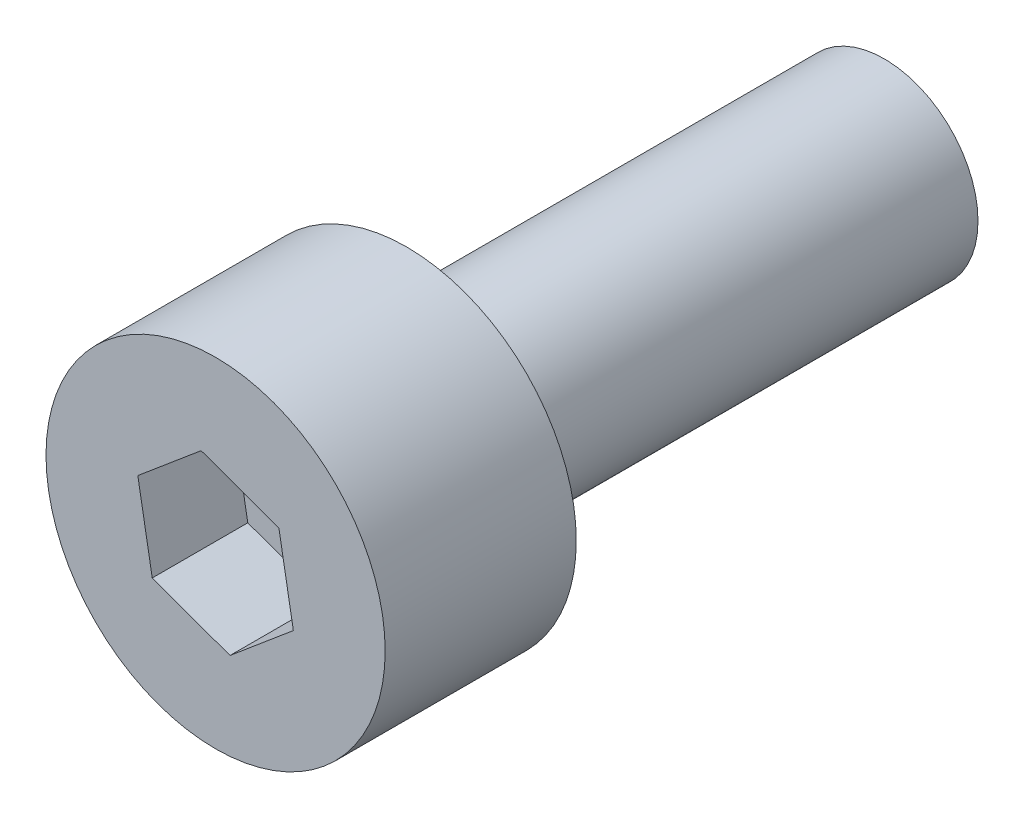
ISO-10303-21;
HEADER;
FILE_DESCRIPTION(('STEP AP214'),'2;1');
FILE_NAME('part.step','',(''),(''),'','','');
FILE_SCHEMA(('AUTOMOTIVE_DESIGN { 1 0 10303 214 1 1 1 1 }'));
ENDSEC;
DATA;
#1=APPLICATION_CONTEXT('core data for automotive mechanical design processes');
#2=APPLICATION_PROTOCOL_DEFINITION('international standard','automotive_design',2000,#1);
#3=PRODUCT_CONTEXT('',#1,'mechanical');
#4=PRODUCT('Part','Part','',(#3));
#5=PRODUCT_RELATED_PRODUCT_CATEGORY('part','',(#4));
#6=PRODUCT_DEFINITION_FORMATION('','',#4);
#7=PRODUCT_DEFINITION_CONTEXT('part definition',#1,'design');
#8=PRODUCT_DEFINITION('design','',#6,#7);
#9=PRODUCT_DEFINITION_SHAPE('','',#8);
#10=(LENGTH_UNIT() NAMED_UNIT(*) SI_UNIT(.MILLI.,.METRE.));
#11=(NAMED_UNIT(*) PLANE_ANGLE_UNIT() SI_UNIT($,.RADIAN.));
#12=(NAMED_UNIT(*) SI_UNIT($,.STERADIAN.) SOLID_ANGLE_UNIT());
#13=UNCERTAINTY_MEASURE_WITH_UNIT(LENGTH_MEASURE(1.E-05),#10,'distance_accuracy_value','');
#14=(GEOMETRIC_REPRESENTATION_CONTEXT(3) GLOBAL_UNCERTAINTY_ASSIGNED_CONTEXT((#13)) GLOBAL_UNIT_ASSIGNED_CONTEXT((#10,
#11,#12)) REPRESENTATION_CONTEXT('',''));
#15=CARTESIAN_POINT('',(0.,0.,0.));
#16=DIRECTION('',(0.,0.,1.));
#17=DIRECTION('',(1.,0.,0.));
#18=AXIS2_PLACEMENT_3D('',#15,#16,#17);
#19=CARTESIAN_POINT('',(0.,0.,10.));
#20=DIRECTION('',(0.,0.,-1.));
#21=DIRECTION('',(-1.,0.,0.));
#22=AXIS2_PLACEMENT_3D('',#19,#20,#21);
#23=CYLINDRICAL_SURFACE('',#22,1.96);
#24=CARTESIAN_POINT('',(0.,0.,10.));
#25=DIRECTION('',(0.,0.,1.));
#26=DIRECTION('',(1.,0.,0.));
#27=AXIS2_PLACEMENT_3D('',#24,#25,#26);
#28=CIRCLE('',#27,1.96);
#29=CARTESIAN_POINT('',(1.96,0.,10.));
#30=VERTEX_POINT('',#29);
#31=EDGE_CURVE('E11',#30,#30,#28,.T.);
#32=ORIENTED_EDGE('',*,*,#31,.F.);
#33=EDGE_LOOP('',(#32));
#34=FACE_BOUND('',#33,.T.);
#35=CARTESIAN_POINT('',(0.,0.,0.));
#36=DIRECTION('',(0.,0.,1.));
#37=DIRECTION('',(1.,0.,0.));
#38=AXIS2_PLACEMENT_3D('',#35,#36,#37);
#39=CIRCLE('',#38,1.96);
#40=CARTESIAN_POINT('',(1.96,0.,0.));
#41=VERTEX_POINT('',#40);
#42=EDGE_CURVE('E35',#41,#41,#39,.T.);
#43=ORIENTED_EDGE('',*,*,#42,.T.);
#44=EDGE_LOOP('',(#43));
#45=FACE_BOUND('',#44,.T.);
#46=ADVANCED_FACE('F32',(#34,#45),#23,.T.);
#47=CARTESIAN_POINT('',(0.,0.,0.));
#48=DIRECTION('',(0.,0.,1.));
#49=DIRECTION('',(1.,0.,0.));
#50=AXIS2_PLACEMENT_3D('',#47,#48,#49);
#51=PLANE('',#50);
#52=ORIENTED_EDGE('',*,*,#42,.F.);
#53=EDGE_LOOP('',(#52));
#54=FACE_BOUND('',#53,.T.);
#55=ADVANCED_FACE('F150',(#54),#51,.F.);
#56=CARTESIAN_POINT('',(0.,0.,10.));
#57=DIRECTION('',(0.,0.,1.));
#58=DIRECTION('',(1.,0.,0.));
#59=AXIS2_PLACEMENT_3D('',#56,#57,#58);
#60=PLANE('',#59);
#61=CARTESIAN_POINT('',(0.,0.,10.));
#62=DIRECTION('',(0.,0.,1.));
#63=DIRECTION('',(1.,0.,0.));
#64=AXIS2_PLACEMENT_3D('',#61,#62,#63);
#65=CIRCLE('',#64,3.55);
#66=CARTESIAN_POINT('',(3.55,0.,10.));
#67=VERTEX_POINT('',#66);
#68=EDGE_CURVE('E133',#67,#67,#65,.T.);
#69=ORIENTED_EDGE('',*,*,#68,.F.);
#70=EDGE_LOOP('',(#69));
#71=FACE_BOUND('',#70,.T.);
#72=ORIENTED_EDGE('',*,*,#31,.T.);
#73=EDGE_LOOP('',(#72));
#74=FACE_BOUND('',#73,.T.);
#75=ADVANCED_FACE('F147',(#71,#74),#60,.F.);
#76=CARTESIAN_POINT('',(0.,0.,14.));
#77=DIRECTION('',(0.,0.,-1.));
#78=DIRECTION('',(-1.,0.,0.));
#79=AXIS2_PLACEMENT_3D('',#76,#77,#78);
#80=CYLINDRICAL_SURFACE('',#79,3.55);
#81=CARTESIAN_POINT('',(0.,0.,14.));
#82=DIRECTION('',(0.,0.,1.));
#83=DIRECTION('',(1.,0.,0.));
#84=AXIS2_PLACEMENT_3D('',#81,#82,#83);
#85=CIRCLE('',#84,3.55);
#86=CARTESIAN_POINT('',(3.55,0.,14.));
#87=VERTEX_POINT('',#86);
#88=EDGE_CURVE('E139',#87,#87,#85,.T.);
#89=ORIENTED_EDGE('',*,*,#88,.F.);
#90=EDGE_LOOP('',(#89));
#91=FACE_BOUND('',#90,.T.);
#92=ORIENTED_EDGE('',*,*,#68,.T.);
#93=EDGE_LOOP('',(#92));
#94=FACE_BOUND('',#93,.T.);
#95=ADVANCED_FACE('F145',(#91,#94),#80,.T.);
#96=CARTESIAN_POINT('',(0.,0.,14.));
#97=DIRECTION('',(0.,0.,1.));
#98=DIRECTION('',(1.,0.,0.));
#99=AXIS2_PLACEMENT_3D('',#96,#97,#98);
#100=PLANE('',#99);
#101=DIRECTION('',(-0.174536153569573,0.984650766057254,0.));
#102=VECTOR('',#101,1.);
#103=CARTESIAN_POINT('',(1.62812889195595,-0.590928346907031,14.));
#104=LINE('',#103,#102);
#105=CARTESIAN_POINT('',(1.62812889195595,-0.590928346907031,14.));
#106=VERTEX_POINT('',#105);
#107=CARTESIAN_POINT('',(1.32582340621581,1.11453680761575,14.));
#108=VERTEX_POINT('',#107);
#109=EDGE_CURVE('E46',#106,#108,#104,.T.);
#110=ORIENTED_EDGE('',*,*,#109,.F.);
#111=DIRECTION('',(0.765464500476604,0.6434781258987,0.));
#112=VECTOR('',#111,1.);
#113=CARTESIAN_POINT('',(0.302305485740145,-1.70546515452278,14.));
#114=LINE('',#113,#112);
#115=CARTESIAN_POINT('',(0.302305485740145,-1.70546515452278,14.));
#116=VERTEX_POINT('',#115);
#117=EDGE_CURVE('E129',#116,#106,#114,.T.);
#118=ORIENTED_EDGE('',*,*,#117,.F.);
#119=DIRECTION('',(0.940000654046177,-0.341172640158555,0.));
#120=VECTOR('',#119,1.);
#121=CARTESIAN_POINT('',(-1.32582340621581,-1.11453680761575,14.));
#122=LINE('',#121,#120);
#123=CARTESIAN_POINT('',(-1.32582340621581,-1.11453680761575,14.));
#124=VERTEX_POINT('',#123);
#125=EDGE_CURVE('E127',#124,#116,#122,.T.);
#126=ORIENTED_EDGE('',*,*,#125,.F.);
#127=DIRECTION('',(0.174536153569573,-0.984650766057255,0.));
#128=VECTOR('',#127,1.);
#129=CARTESIAN_POINT('',(-1.62812889195595,0.59092834690703,14.));
#130=LINE('',#129,#128);
#131=CARTESIAN_POINT('',(-1.62812889195595,0.59092834690703,14.));
#132=VERTEX_POINT('',#131);
#133=EDGE_CURVE('E94',#132,#124,#130,.T.);
#134=ORIENTED_EDGE('',*,*,#133,.F.);
#135=DIRECTION('',(-0.765464500476604,-0.6434781258987,0.));
#136=VECTOR('',#135,1.);
#137=CARTESIAN_POINT('',(-0.302305485740145,1.70546515452278,14.));
#138=LINE('',#137,#136);
#139=CARTESIAN_POINT('',(-0.302305485740145,1.70546515452278,14.));
#140=VERTEX_POINT('',#139);
#141=EDGE_CURVE('E123',#140,#132,#138,.T.);
#142=ORIENTED_EDGE('',*,*,#141,.F.);
#143=DIRECTION('',(-0.940000654046177,0.341172640158555,0.));
#144=VECTOR('',#143,1.);
#145=CARTESIAN_POINT('',(1.32582340621581,1.11453680761575,14.));
#146=LINE('',#145,#144);
#147=EDGE_CURVE('E120',#108,#140,#146,.T.);
#148=ORIENTED_EDGE('',*,*,#147,.F.);
#149=EDGE_LOOP('',(#110,#118,#126,#134,#142,#148));
#150=FACE_BOUND('',#149,.T.);
#151=ORIENTED_EDGE('',*,*,#88,.T.);
#152=EDGE_LOOP('',(#151));
#153=FACE_BOUND('',#152,.T.);
#154=ADVANCED_FACE('F164',(#150,#153),#100,.T.);
#155=CARTESIAN_POINT('',(1.62812889195595,-0.590928346907031,12.));
#156=DIRECTION('',(0.984650766057255,0.174536153569573,0.));
#157=DIRECTION('',(-0.174536153569573,0.984650766057255,0.));
#158=AXIS2_PLACEMENT_3D('',#155,#156,#157);
#159=PLANE('',#158);
#160=ORIENTED_EDGE('',*,*,#109,.T.);
#161=DIRECTION('',(0.,0.,1.));
#162=VECTOR('',#161,1.);
#163=CARTESIAN_POINT('',(1.32582340621581,1.11453680761575,12.));
#164=LINE('',#163,#162);
#165=CARTESIAN_POINT('',(1.32582340621581,1.11453680761575,12.));
#166=VERTEX_POINT('',#165);
#167=EDGE_CURVE('E76',#166,#108,#164,.T.);
#168=ORIENTED_EDGE('',*,*,#167,.F.);
#169=DIRECTION('',(-0.174536153569573,0.984650766057254,0.));
#170=VECTOR('',#169,1.);
#171=CARTESIAN_POINT('',(1.62812889195595,-0.590928346907031,12.));
#172=LINE('',#171,#170);
#173=CARTESIAN_POINT('',(1.62812889195595,-0.590928346907031,12.));
#174=VERTEX_POINT('',#173);
#175=EDGE_CURVE('E131',#174,#166,#172,.T.);
#176=ORIENTED_EDGE('',*,*,#175,.F.);
#177=DIRECTION('',(0.,0.,1.));
#178=VECTOR('',#177,1.);
#179=CARTESIAN_POINT('',(1.62812889195595,-0.590928346907031,12.));
#180=LINE('',#179,#178);
#181=EDGE_CURVE('E54',#174,#106,#180,.T.);
#182=ORIENTED_EDGE('',*,*,#181,.T.);
#183=EDGE_LOOP('',(#160,#168,#176,#182));
#184=FACE_BOUND('',#183,.T.);
#185=ADVANCED_FACE('F169',(#184),#159,.F.);
#186=CARTESIAN_POINT('',(0.302305485740145,-1.70546515452278,12.));
#187=DIRECTION('',(0.6434781258987,-0.765464500476604,0.));
#188=DIRECTION('',(0.765464500476604,0.6434781258987,0.));
#189=AXIS2_PLACEMENT_3D('',#186,#187,#188);
#190=PLANE('',#189);
#191=ORIENTED_EDGE('',*,*,#117,.T.);
#192=ORIENTED_EDGE('',*,*,#181,.F.);
#193=DIRECTION('',(0.765464500476604,0.6434781258987,0.));
#194=VECTOR('',#193,1.);
#195=CARTESIAN_POINT('',(0.302305485740145,-1.70546515452278,12.));
#196=LINE('',#195,#194);
#197=CARTESIAN_POINT('',(0.302305485740145,-1.70546515452278,12.));
#198=VERTEX_POINT('',#197);
#199=EDGE_CURVE('E106',#198,#174,#196,.T.);
#200=ORIENTED_EDGE('',*,*,#199,.F.);
#201=DIRECTION('',(0.,0.,1.));
#202=VECTOR('',#201,1.);
#203=CARTESIAN_POINT('',(0.302305485740145,-1.70546515452278,12.));
#204=LINE('',#203,#202);
#205=EDGE_CURVE('E98',#198,#116,#204,.T.);
#206=ORIENTED_EDGE('',*,*,#205,.T.);
#207=EDGE_LOOP('',(#191,#192,#200,#206));
#208=FACE_BOUND('',#207,.T.);
#209=ADVANCED_FACE('F173',(#208),#190,.F.);
#210=CARTESIAN_POINT('',(-1.32582340621581,-1.11453680761575,12.));
#211=DIRECTION('',(-0.341172640158555,-0.940000654046177,0.));
#212=DIRECTION('',(0.940000654046177,-0.341172640158555,0.));
#213=AXIS2_PLACEMENT_3D('',#210,#211,#212);
#214=PLANE('',#213);
#215=ORIENTED_EDGE('',*,*,#125,.T.);
#216=ORIENTED_EDGE('',*,*,#205,.F.);
#217=DIRECTION('',(0.940000654046177,-0.341172640158555,0.));
#218=VECTOR('',#217,1.);
#219=CARTESIAN_POINT('',(-1.32582340621581,-1.11453680761575,12.));
#220=LINE('',#219,#218);
#221=CARTESIAN_POINT('',(-1.32582340621581,-1.11453680761575,12.));
#222=VERTEX_POINT('',#221);
#223=EDGE_CURVE('E102',#222,#198,#220,.T.);
#224=ORIENTED_EDGE('',*,*,#223,.F.);
#225=DIRECTION('',(0.,0.,1.));
#226=VECTOR('',#225,1.);
#227=CARTESIAN_POINT('',(-1.32582340621581,-1.11453680761575,12.));
#228=LINE('',#227,#226);
#229=EDGE_CURVE('E87',#222,#124,#228,.T.);
#230=ORIENTED_EDGE('',*,*,#229,.T.);
#231=EDGE_LOOP('',(#215,#216,#224,#230));
#232=FACE_BOUND('',#231,.T.);
#233=ADVANCED_FACE('F103',(#232),#214,.F.);
#234=CARTESIAN_POINT('',(-1.62812889195595,0.59092834690703,12.));
#235=DIRECTION('',(-0.984650766057255,-0.174536153569573,0.));
#236=DIRECTION('',(0.174536153569573,-0.984650766057255,0.));
#237=AXIS2_PLACEMENT_3D('',#234,#235,#236);
#238=PLANE('',#237);
#239=ORIENTED_EDGE('',*,*,#133,.T.);
#240=ORIENTED_EDGE('',*,*,#229,.F.);
#241=DIRECTION('',(0.174536153569573,-0.984650766057255,0.));
#242=VECTOR('',#241,1.);
#243=CARTESIAN_POINT('',(-1.62812889195595,0.59092834690703,12.));
#244=LINE('',#243,#242);
#245=CARTESIAN_POINT('',(-1.62812889195595,0.59092834690703,12.));
#246=VERTEX_POINT('',#245);
#247=EDGE_CURVE('E91',#246,#222,#244,.T.);
#248=ORIENTED_EDGE('',*,*,#247,.F.);
#249=DIRECTION('',(0.,0.,1.));
#250=VECTOR('',#249,1.);
#251=CARTESIAN_POINT('',(-1.62812889195595,0.59092834690703,12.));
#252=LINE('',#251,#250);
#253=EDGE_CURVE('E99',#246,#132,#252,.T.);
#254=ORIENTED_EDGE('',*,*,#253,.T.);
#255=EDGE_LOOP('',(#239,#240,#248,#254));
#256=FACE_BOUND('',#255,.T.);
#257=ADVANCED_FACE('F89',(#256),#238,.F.);
#258=CARTESIAN_POINT('',(-0.302305485740145,1.70546515452278,12.));
#259=DIRECTION('',(-0.6434781258987,0.765464500476604,0.));
#260=DIRECTION('',(-0.765464500476604,-0.6434781258987,0.));
#261=AXIS2_PLACEMENT_3D('',#258,#259,#260);
#262=PLANE('',#261);
#263=ORIENTED_EDGE('',*,*,#141,.T.);
#264=ORIENTED_EDGE('',*,*,#253,.F.);
#265=DIRECTION('',(-0.765464500476604,-0.6434781258987,0.));
#266=VECTOR('',#265,1.);
#267=CARTESIAN_POINT('',(-0.302305485740145,1.70546515452278,12.));
#268=LINE('',#267,#266);
#269=CARTESIAN_POINT('',(-0.302305485740145,1.70546515452278,12.));
#270=VERTEX_POINT('',#269);
#271=EDGE_CURVE('E112',#270,#246,#268,.T.);
#272=ORIENTED_EDGE('',*,*,#271,.F.);
#273=DIRECTION('',(0.,0.,1.));
#274=VECTOR('',#273,1.);
#275=CARTESIAN_POINT('',(-0.302305485740145,1.70546515452278,12.));
#276=LINE('',#275,#274);
#277=EDGE_CURVE('E136',#270,#140,#276,.T.);
#278=ORIENTED_EDGE('',*,*,#277,.T.);
#279=EDGE_LOOP('',(#263,#264,#272,#278));
#280=FACE_BOUND('',#279,.T.);
#281=ADVANCED_FACE('F177',(#280),#262,.F.);
#282=CARTESIAN_POINT('',(1.32582340621581,1.11453680761575,12.));
#283=DIRECTION('',(0.341172640158555,0.940000654046177,0.));
#284=DIRECTION('',(-0.940000654046177,0.341172640158555,0.));
#285=AXIS2_PLACEMENT_3D('',#282,#283,#284);
#286=PLANE('',#285);
#287=ORIENTED_EDGE('',*,*,#147,.T.);
#288=ORIENTED_EDGE('',*,*,#277,.F.);
#289=DIRECTION('',(-0.940000654046177,0.341172640158555,0.));
#290=VECTOR('',#289,1.);
#291=CARTESIAN_POINT('',(1.32582340621581,1.11453680761575,12.));
#292=LINE('',#291,#290);
#293=EDGE_CURVE('E114',#166,#270,#292,.T.);
#294=ORIENTED_EDGE('',*,*,#293,.F.);
#295=ORIENTED_EDGE('',*,*,#167,.T.);
#296=EDGE_LOOP('',(#287,#288,#294,#295));
#297=FACE_BOUND('',#296,.T.);
#298=ADVANCED_FACE('F174',(#297),#286,.F.);
#299=CARTESIAN_POINT('',(1.32582340621581,1.11453680761575,12.));
#300=DIRECTION('',(0.,0.,1.));
#301=DIRECTION('',(1.,0.,0.));
#302=AXIS2_PLACEMENT_3D('',#299,#300,#301);
#303=PLANE('',#302);
#304=ORIENTED_EDGE('',*,*,#175,.T.);
#305=ORIENTED_EDGE('',*,*,#293,.T.);
#306=ORIENTED_EDGE('',*,*,#271,.T.);
#307=ORIENTED_EDGE('',*,*,#247,.T.);
#308=ORIENTED_EDGE('',*,*,#223,.T.);
#309=ORIENTED_EDGE('',*,*,#199,.T.);
#310=EDGE_LOOP('',(#304,#305,#306,#307,#308,#309));
#311=FACE_BOUND('',#310,.T.);
#312=ADVANCED_FACE('F109',(#311),#303,.T.);
#313=CLOSED_SHELL('',(#46,#55,#75,#95,#154,#185,#209,#233,#257,#281,#298,#312));
#314=MANIFOLD_SOLID_BREP('B2',#313);
#315=ADVANCED_BREP_SHAPE_REPRESENTATION('',(#18,#314),#14);
#316=SHAPE_DEFINITION_REPRESENTATION(#9,#315);
ENDSEC;
END-ISO-10303-21;
